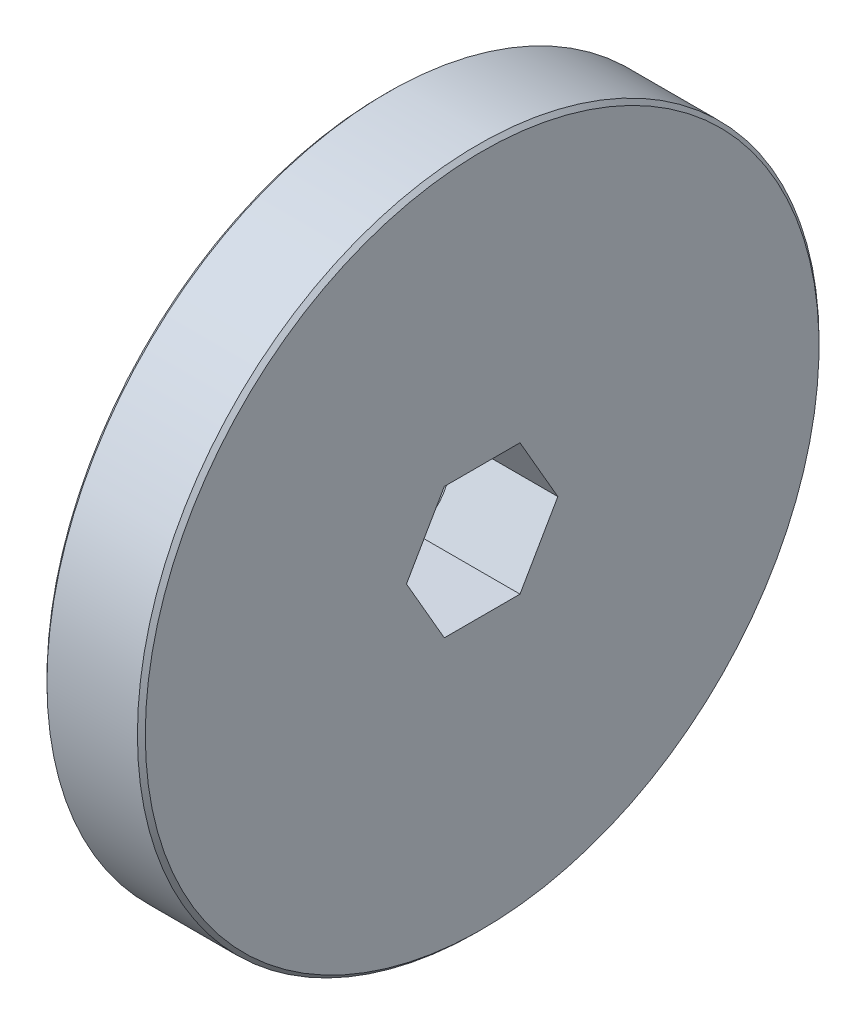
ISO-10303-21;
HEADER;
FILE_DESCRIPTION(('STEP AP214'),'2;1');
FILE_NAME('part.step','',(''),(''),'','','');
FILE_SCHEMA(('AUTOMOTIVE_DESIGN { 1 0 10303 214 1 1 1 1 }'));
ENDSEC;
DATA;
#1=APPLICATION_CONTEXT('core data for automotive mechanical design processes');
#2=APPLICATION_PROTOCOL_DEFINITION('international standard','automotive_design',2000,#1);
#3=PRODUCT_CONTEXT('',#1,'mechanical');
#4=PRODUCT('Part','Part','',(#3));
#5=PRODUCT_RELATED_PRODUCT_CATEGORY('part','',(#4));
#6=PRODUCT_DEFINITION_FORMATION('','',#4);
#7=PRODUCT_DEFINITION_CONTEXT('part definition',#1,'design');
#8=PRODUCT_DEFINITION('design','',#6,#7);
#9=PRODUCT_DEFINITION_SHAPE('','',#8);
#10=(LENGTH_UNIT() NAMED_UNIT(*) SI_UNIT(.MILLI.,.METRE.));
#11=(NAMED_UNIT(*) PLANE_ANGLE_UNIT() SI_UNIT($,.RADIAN.));
#12=(NAMED_UNIT(*) SI_UNIT($,.STERADIAN.) SOLID_ANGLE_UNIT());
#13=UNCERTAINTY_MEASURE_WITH_UNIT(LENGTH_MEASURE(1.E-05),#10,'distance_accuracy_value','');
#14=(GEOMETRIC_REPRESENTATION_CONTEXT(3) GLOBAL_UNCERTAINTY_ASSIGNED_CONTEXT((#13)) GLOBAL_UNIT_ASSIGNED_CONTEXT((#10,
#11,#12)) REPRESENTATION_CONTEXT('',''));
#15=CARTESIAN_POINT('',(0.,0.,0.));
#16=DIRECTION('',(0.,0.,1.));
#17=DIRECTION('',(1.,0.,0.));
#18=AXIS2_PLACEMENT_3D('',#15,#16,#17);
#19=CARTESIAN_POINT('',(837.258566213659,214.232644835281,0.));
#20=DIRECTION('',(1.,0.,0.));
#21=DIRECTION('',(0.,1.,0.));
#22=AXIS2_PLACEMENT_3D('',#19,#20,#21);
#23=TOROIDAL_SURFACE('',#22,8.19150000000003,0.253999999999916);
#24=CARTESIAN_POINT('',(837.512566213659,214.232644835281,0.));
#25=DIRECTION('',(1.,0.,0.));
#26=DIRECTION('',(0.,1.,0.));
#27=AXIS2_PLACEMENT_3D('',#24,#25,#26);
#28=CIRCLE('',#27,8.19149999999999);
#29=CARTESIAN_POINT('',(837.512566213659,222.424144835281,0.));
#30=VERTEX_POINT('',#29);
#31=EDGE_CURVE('E20',#30,#30,#28,.T.);
#32=ORIENTED_EDGE('',*,*,#31,.F.);
#33=EDGE_LOOP('',(#32));
#34=FACE_BOUND('',#33,.T.);
#35=CARTESIAN_POINT('',(837.258566213659,214.232644835281,0.));
#36=DIRECTION('',(1.,0.,0.));
#37=DIRECTION('',(0.,0.,-1.));
#38=AXIS2_PLACEMENT_3D('',#35,#36,#37);
#39=CIRCLE('',#38,7.9375);
#40=CARTESIAN_POINT('',(837.258566213659,214.232644835281,-7.9375));
#41=VERTEX_POINT('',#40);
#42=EDGE_CURVE('E156',#41,#41,#39,.F.);
#43=ORIENTED_EDGE('',*,*,#42,.F.);
#44=EDGE_LOOP('',(#43));
#45=FACE_BOUND('',#44,.T.);
#46=ADVANCED_FACE('F17',(#34,#45),#23,.F.);
#47=CARTESIAN_POINT('',(837.195066213659,214.232644835281,0.));
#48=DIRECTION('',(1.,0.,0.));
#49=DIRECTION('',(0.,0.,-1.));
#50=AXIS2_PLACEMENT_3D('',#47,#48,#49);
#51=CYLINDRICAL_SURFACE('',#50,7.9375);
#52=ORIENTED_EDGE('',*,*,#42,.T.);
#53=EDGE_LOOP('',(#52));
#54=FACE_BOUND('',#53,.T.);
#55=CARTESIAN_POINT('',(837.131566213773,214.232644835281,0.));
#56=DIRECTION('',(1.,0.,0.));
#57=DIRECTION('',(0.,-1.,0.));
#58=AXIS2_PLACEMENT_3D('',#55,#56,#57);
#59=CIRCLE('',#58,7.93749999988619);
#60=CARTESIAN_POINT('',(837.131566213773,206.295144835395,0.));
#61=VERTEX_POINT('',#60);
#62=EDGE_CURVE('E150',#61,#61,#59,.F.);
#63=ORIENTED_EDGE('',*,*,#62,.F.);
#64=EDGE_LOOP('',(#63));
#65=FACE_BOUND('',#64,.T.);
#66=ADVANCED_FACE('F335',(#54,#65),#51,.T.);
#67=CARTESIAN_POINT('',(837.512566213659,234.711394835281,0.));
#68=DIRECTION('',(-1.,0.,0.));
#69=DIRECTION('',(0.,0.,1.));
#70=AXIS2_PLACEMENT_3D('',#67,#68,#69);
#71=PLANE('',#70);
#72=ORIENTED_EDGE('',*,*,#31,.T.);
#73=EDGE_LOOP('',(#72));
#74=FACE_BOUND('',#73,.T.);
#75=CARTESIAN_POINT('',(837.512566213488,214.232644835281,0.));
#76=DIRECTION('',(1.,0.,0.));
#77=DIRECTION('',(0.,0.,-1.));
#78=AXIS2_PLACEMENT_3D('',#75,#76,#77);
#79=CIRCLE('',#78,32.6390000001711);
#80=CARTESIAN_POINT('',(837.512566213488,214.232644835281,-32.6390000001711));
#81=VERTEX_POINT('',#80);
#82=EDGE_CURVE('E153',#81,#81,#79,.T.);
#83=ORIENTED_EDGE('',*,*,#82,.F.);
#84=EDGE_LOOP('',(#83));
#85=FACE_BOUND('',#84,.T.);
#86=ADVANCED_FACE('F326',(#74,#85),#71,.T.);
#87=CARTESIAN_POINT('',(837.131566213773,214.232644835281,0.));
#88=DIRECTION('',(1.,0.,0.));
#89=DIRECTION('',(0.,0.,-1.));
#90=AXIS2_PLACEMENT_3D('',#87,#88,#89);
#91=CONICAL_SURFACE('',#90,7.93749999988616,0.785398162499982);
#92=ORIENTED_EDGE('',*,*,#62,.T.);
#93=EDGE_LOOP('',(#92));
#94=FACE_BOUND('',#93,.T.);
#95=CARTESIAN_POINT('',(836.877566213545,214.232644835281,0.));
#96=DIRECTION('',(1.,0.,0.));
#97=DIRECTION('',(0.,0.,-1.));
#98=AXIS2_PLACEMENT_3D('',#95,#96,#97);
#99=CIRCLE('',#98,7.68350000011406);
#100=CARTESIAN_POINT('',(836.877566213545,214.232644835281,-7.68350000011406));
#101=VERTEX_POINT('',#100);
#102=EDGE_CURVE('E147',#101,#101,#99,.F.);
#103=ORIENTED_EDGE('',*,*,#102,.F.);
#104=EDGE_LOOP('',(#103));
#105=FACE_BOUND('',#104,.T.);
#106=ADVANCED_FACE('F317',(#94,#105),#91,.T.);
#107=CARTESIAN_POINT('',(837.89356621383,214.232644835281,0.));
#108=DIRECTION('',(1.,0.,0.));
#109=DIRECTION('',(0.,0.,-1.));
#110=AXIS2_PLACEMENT_3D('',#107,#108,#109);
#111=CONICAL_SURFACE('',#110,33.019999999829,0.785398162500018);
#112=CARTESIAN_POINT('',(837.893566213659,214.232644835281,0.));
#113=DIRECTION('',(1.,0.,0.));
#114=DIRECTION('',(0.,0.,-1.));
#115=AXIS2_PLACEMENT_3D('',#112,#113,#114);
#116=CIRCLE('',#115,33.02);
#117=CARTESIAN_POINT('',(837.893566213659,214.232644835281,-33.02));
#118=VERTEX_POINT('',#117);
#119=EDGE_CURVE('E144',#118,#118,#116,.T.);
#120=ORIENTED_EDGE('',*,*,#119,.F.);
#121=EDGE_LOOP('',(#120));
#122=FACE_BOUND('',#121,.T.);
#123=ORIENTED_EDGE('',*,*,#82,.T.);
#124=EDGE_LOOP('',(#123));
#125=FACE_BOUND('',#124,.T.);
#126=ADVANCED_FACE('F308',(#122,#125),#111,.T.);
#127=CARTESIAN_POINT('',(836.877566213659,218.201394835281,0.));
#128=DIRECTION('',(-1.,0.,0.));
#129=DIRECTION('',(0.,0.,1.));
#130=AXIS2_PLACEMENT_3D('',#127,#128,#129);
#131=PLANE('',#130);
#132=CARTESIAN_POINT('',(836.877566213161,214.232644835281,0.));
#133=DIRECTION('',(-1.,0.,0.));
#134=DIRECTION('',(0.,0.,1.));
#135=AXIS2_PLACEMENT_3D('',#132,#133,#134);
#136=CIRCLE('',#135,7.36599999950355);
#137=CARTESIAN_POINT('',(836.877566213161,214.232644835281,7.36599999950355));
#138=VERTEX_POINT('',#137);
#139=EDGE_CURVE('E116',#138,#138,#136,.F.);
#140=ORIENTED_EDGE('',*,*,#139,.T.);
#141=EDGE_LOOP('',(#140));
#142=FACE_BOUND('',#141,.T.);
#143=ORIENTED_EDGE('',*,*,#102,.T.);
#144=EDGE_LOOP('',(#143));
#145=FACE_BOUND('',#144,.T.);
#146=ADVANCED_FACE('F300',(#142,#145),#131,.T.);
#147=CARTESIAN_POINT('',(842.275066213659,214.232644835281,0.));
#148=DIRECTION('',(1.,0.,0.));
#149=DIRECTION('',(0.,0.,-1.));
#150=AXIS2_PLACEMENT_3D('',#147,#148,#149);
#151=CYLINDRICAL_SURFACE('',#150,33.02);
#152=CARTESIAN_POINT('',(846.656566213488,214.232644835281,0.));
#153=DIRECTION('',(-1.,0.,0.));
#154=DIRECTION('',(0.,-1.,0.));
#155=AXIS2_PLACEMENT_3D('',#152,#153,#154);
#156=CIRCLE('',#155,33.0199999998289);
#157=CARTESIAN_POINT('',(846.656566213488,181.212644835452,0.));
#158=VERTEX_POINT('',#157);
#159=EDGE_CURVE('E83',#158,#158,#156,.F.);
#160=ORIENTED_EDGE('',*,*,#159,.F.);
#161=EDGE_LOOP('',(#160));
#162=FACE_BOUND('',#161,.T.);
#163=ORIENTED_EDGE('',*,*,#119,.T.);
#164=EDGE_LOOP('',(#163));
#165=FACE_BOUND('',#164,.T.);
#166=ADVANCED_FACE('F222',(#162,#165),#151,.T.);
#167=CARTESIAN_POINT('',(836.877566213218,214.232644835281,0.));
#168=DIRECTION('',(-1.,0.,0.));
#169=DIRECTION('',(0.,0.,1.));
#170=AXIS2_PLACEMENT_3D('',#167,#168,#169);
#171=CONICAL_SURFACE('',#170,7.3659999994467,0.785398162452001);
#172=ORIENTED_EDGE('',*,*,#139,.F.);
#173=EDGE_LOOP('',(#172));
#174=FACE_BOUND('',#173,.T.);
#175=CARTESIAN_POINT('',(836.911217794257,214.232644834923,7.33234841863607));
#176=CARTESIAN_POINT('',(836.973830603347,214.124180683572,7.26972661157141));
#177=CARTESIAN_POINT('',(837.034534089978,214.014887769776,7.20662631833454));
#178=CARTESIAN_POINT('',(837.151546478303,213.794483319738,7.07937574974711));
#179=CARTESIAN_POINT('',(837.207852987084,213.683370832495,7.01522492533614));
#180=CARTESIAN_POINT('',(837.369857452663,213.345897340855,6.82038451410754));
#181=CARTESIAN_POINT('',(837.467875044735,213.116697540088,6.68805594742965));
#182=CARTESIAN_POINT('',(837.637074152675,212.651621421287,6.41954412504063));
#183=CARTESIAN_POINT('',(837.70834649277,212.415770678043,6.283375634941));
#184=CARTESIAN_POINT('',(837.790739840542,212.058147801841,6.07690197110029));
#185=CARTESIAN_POINT('',(837.814104636753,211.938449250899,6.00779398049335));
#186=CARTESIAN_POINT('',(837.852131800152,211.698034210042,5.86899029193359));
#187=CARTESIAN_POINT('',(837.866797060875,211.577318072149,5.79929479722059));
#188=CARTESIAN_POINT('',(837.882441377277,211.389977126495,5.69113345182765));
#189=CARTESIAN_POINT('',(837.886610236211,211.323541823466,5.65277701174747));
#190=CARTESIAN_POINT('',(837.892173188683,211.1906222726,5.57603587325199));
#191=CARTESIAN_POINT('',(837.893568789556,211.124138071011,5.53765120153746));
#192=CARTESIAN_POINT('',(837.893559751848,210.890759884875,5.40291024289958));
#193=CARTESIAN_POINT('',(837.884746021082,210.723818027523,5.30652631668492));
#194=CARTESIAN_POINT('',(837.849974128495,210.391214535692,5.11449760119143));
#195=CARTESIAN_POINT('',(837.824004008835,210.22555387573,5.01885337455021));
#196=CARTESIAN_POINT('',(837.756140277196,209.895930925233,4.82854547533702));
#197=CARTESIAN_POINT('',(837.714173438657,209.731980061256,4.73388839989082));
#198=CARTESIAN_POINT('',(837.616234674376,209.407230636299,4.5463942319762));
#199=CARTESIAN_POINT('',(837.560257345261,209.246433317395,4.45355785662091));
#200=CARTESIAN_POINT('',(837.417453831287,208.879752331086,4.24185449046731));
#201=CARTESIAN_POINT('',(837.326427411754,208.675097477153,4.12369695545861));
#202=CARTESIAN_POINT('',(837.178346077161,208.373561552368,3.94960510811356));
#203=CARTESIAN_POINT('',(837.127319077046,208.274394805897,3.89235116034438));
#204=CARTESIAN_POINT('',(837.021778073516,208.077480800181,3.77866280613645));
#205=CARTESIAN_POINT('',(836.967264650644,207.979733307916,3.72222826516472));
#206=CARTESIAN_POINT('',(836.911217794203,207.882644835598,3.66617420953671));
#207=B_SPLINE_CURVE_WITH_KNOTS('',3,(#175,#176,#177,#178,#179,#180,#181,#182,#183,#184,#185,
#186,#187,#188,#189,#190,#191,#192,#193,#194,#195,#196,#197,#198,#199,#200,#201,#202,#203,#204,
#205,#206),.UNSPECIFIED.,.F.,.F.,(4,2,2,2,2,2,2,2,2,2,2,2,2,2,2,4),(0.,0.420044475301416,
0.840315975752731,1.68589271251405,2.52857139463436,2.94887379457989,3.36903632007069,
3.59946881286421,3.82977602554547,4.40780185575734,4.98623099013496,5.56734037250001,
6.14867421539335,6.90755565769996,7.28360145065073,7.65958478861319),.UNSPECIFIED.);
#208=CARTESIAN_POINT('',(836.911217794206,214.232644835281,7.33234841852208));
#209=VERTEX_POINT('',#208);
#210=CARTESIAN_POINT('',(836.911217794206,207.882644835443,3.66617420926103));
#211=VERTEX_POINT('',#210);
#212=EDGE_CURVE('E90',#209,#211,#207,.T.);
#213=ORIENTED_EDGE('',*,*,#212,.T.);
#214=CARTESIAN_POINT('',(836.911217794257,207.882644835165,3.6661742090074));
#215=CARTESIAN_POINT('',(836.973830603347,207.882644835238,3.54093059500579));
#216=CARTESIAN_POINT('',(837.034534089978,207.88264483527,3.41473000858626));
#217=CARTESIAN_POINT('',(837.151546478303,207.882644835293,3.1602288714524));
#218=CARTESIAN_POINT('',(837.207852987084,207.882644835285,3.03192722261719));
#219=CARTESIAN_POINT('',(837.369857452664,207.882644835273,2.64224640013831));
#220=CARTESIAN_POINT('',(837.467875044735,207.882644835279,2.37758926679267));
#221=CARTESIAN_POINT('',(837.637074152675,207.882644835284,1.84056562202312));
#222=CARTESIAN_POINT('',(837.70834649277,207.882644835283,1.56822864182226));
#223=CARTESIAN_POINT('',(837.790739840542,207.882644835281,1.1552813141368));
#224=CARTESIAN_POINT('',(837.814104636753,207.88264483528,1.01706533292132));
#225=CARTESIAN_POINT('',(837.852131800152,207.882644835283,0.739457955807751));
#226=CARTESIAN_POINT('',(837.866797060875,207.882644835287,0.600066966389303));
#227=CARTESIAN_POINT('',(837.882441377277,207.882644835278,0.383744275587131));
#228=CARTESIAN_POINT('',(837.886610236211,207.882644835272,0.307031395415571));
#229=CARTESIAN_POINT('',(837.892173188682,207.882644835291,0.153549118458618));
#230=CARTESIAN_POINT('',(837.893568789556,207.882644835317,0.0767797750747144));
#231=CARTESIAN_POINT('',(837.893559751848,207.88264483536,-0.192702142127321));
#232=CARTESIAN_POINT('',(837.884746021082,207.882644835302,-0.38546999465605));
#233=CARTESIAN_POINT('',(837.849974128495,207.88264483526,-0.769527425715887));
#234=CARTESIAN_POINT('',(837.824004008835,207.882644835276,-0.960815878971684));
#235=CARTESIAN_POINT('',(837.756140277196,207.882644835287,-1.34143167737843));
#236=CARTESIAN_POINT('',(837.714173438657,207.882644835283,-1.53074582827802));
#237=CARTESIAN_POINT('',(837.616234674376,207.88264483528,-1.90573416411256));
#238=CARTESIAN_POINT('',(837.560257345261,207.882644835281,-2.09140691482126));
#239=CARTESIAN_POINT('',(837.417453831287,207.882644835282,-2.51481364712664));
#240=CARTESIAN_POINT('',(837.326427411754,207.882644835281,-2.75112871714489));
#241=CARTESIAN_POINT('',(837.178346077161,207.882644835281,-3.09931241183528));
#242=CARTESIAN_POINT('',(837.127319077046,207.882644835281,-3.21382030737361));
#243=CARTESIAN_POINT('',(837.021778073516,207.882644835281,-3.44119701578936));
#244=CARTESIAN_POINT('',(836.967264650644,207.882644835281,-3.55406609773275));
#245=CARTESIAN_POINT('',(836.911217794203,207.882644835281,-3.66617420898888));
#246=B_SPLINE_CURVE_WITH_KNOTS('',3,(#214,#215,#216,#217,#218,#219,#220,#221,#222,#223,#224,
#225,#226,#227,#228,#229,#230,#231,#232,#233,#234,#235,#236,#237,#238,#239,#240,#241,#242,#243,
#244,#245),.UNSPECIFIED.,.F.,.F.,(4,2,2,2,2,2,2,2,2,2,2,2,2,2,2,4),(0.,0.420044475301383,
0.840315975752615,1.68589271251407,2.52857139463442,2.94887379457991,3.36903632007072,
3.59946881286417,3.8297760255454,4.40780185575729,4.98623099013489,5.56734037249991,
6.14867421539325,6.90755565769986,7.28360145065072,7.6595847886131),.UNSPECIFIED.);
#247=CARTESIAN_POINT('',(836.911217794206,207.882644835443,-3.66617420926103));
#248=VERTEX_POINT('',#247);
#249=EDGE_CURVE('E102',#211,#248,#246,.T.);
#250=ORIENTED_EDGE('',*,*,#249,.T.);
#251=CARTESIAN_POINT('',(836.911217794257,207.882644835523,-3.66617420962868));
#252=CARTESIAN_POINT('',(836.973830603347,207.991108986947,-3.72879601656565));
#253=CARTESIAN_POINT('',(837.034534089978,208.100401900775,-3.79189630974833));
#254=CARTESIAN_POINT('',(837.151546478303,208.320806350837,-3.9191468782948));
#255=CARTESIAN_POINT('',(837.207852987084,208.431918838071,-3.98329770271905));
#256=CARTESIAN_POINT('',(837.369857452663,208.769392329699,-4.1781381139693));
#257=CARTESIAN_POINT('',(837.467875044735,208.998592130472,-4.31046668063702));
#258=CARTESIAN_POINT('',(837.637074152675,209.463668249278,-4.57897850301747));
#259=CARTESIAN_POINT('',(837.70834649277,209.699518992522,-4.71514699311866));
#260=CARTESIAN_POINT('',(837.790739840542,210.057141868721,-4.92162065696339));
#261=CARTESIAN_POINT('',(837.814104636753,210.176840419662,-4.99072864757195));
#262=CARTESIAN_POINT('',(837.852131800152,210.417255460522,-5.12953233612578));
#263=CARTESIAN_POINT('',(837.866797060875,210.537971598419,-5.19922783083123));
#264=CARTESIAN_POINT('',(837.882441377277,210.725312544064,-5.30738917624048));
#265=CARTESIAN_POINT('',(837.886610236211,210.791747847087,-5.34574561633188));
#266=CARTESIAN_POINT('',(837.892173188682,210.924667397972,-5.42248675479339));
#267=CARTESIAN_POINT('',(837.893568789556,210.991151599588,-5.46087142646276));
#268=CARTESIAN_POINT('',(837.893559751848,211.224529785767,-5.59561238502693));
#269=CARTESIAN_POINT('',(837.884746021082,211.391471643061,-5.69199631134103));
#270=CARTESIAN_POINT('',(837.849974128495,211.72407513485,-5.88402502690739));
#271=CARTESIAN_POINT('',(837.824004008835,211.889735794827,-5.97966925352195));
#272=CARTESIAN_POINT('',(837.756140277196,212.219358745335,-6.1699771527155));
#273=CARTESIAN_POINT('',(837.714173438657,212.383309609308,-6.26463422816889));
#274=CARTESIAN_POINT('',(837.616234674376,212.708059034262,-6.45212839608881));
#275=CARTESIAN_POINT('',(837.560257345261,212.868856353167,-6.54496477144223));
#276=CARTESIAN_POINT('',(837.417453831287,213.235537339477,-6.75666813759401));
#277=CARTESIAN_POINT('',(837.326427411754,213.44019219341,-6.87482567260354));
#278=CARTESIAN_POINT('',(837.178346077161,213.741728118195,-7.04891751994889));
#279=CARTESIAN_POINT('',(837.127319077046,213.840894864665,-7.10617146771804));
#280=CARTESIAN_POINT('',(837.021778073516,214.037808870382,-7.21985982192585));
#281=CARTESIAN_POINT('',(836.967264650644,214.135556362647,-7.27629436289752));
#282=CARTESIAN_POINT('',(836.911217794203,214.232644834965,-7.33234841852561));
#283=B_SPLINE_CURVE_WITH_KNOTS('',3,(#251,#252,#253,#254,#255,#256,#257,#258,#259,#260,#261,
#262,#263,#264,#265,#266,#267,#268,#269,#270,#271,#272,#273,#274,#275,#276,#277,#278,#279,#280,
#281,#282),.UNSPECIFIED.,.F.,.F.,(4,2,2,2,2,2,2,2,2,2,2,2,2,2,2,4),(0.,0.420044475301433,
0.840315975752691,1.68589271251398,2.52857139463422,2.94887379457974,3.36903632007059,
3.59946881286408,3.82977602554536,4.4078018557573,4.98623099013485,5.56734037249987,
6.14867421539321,6.90755565769985,7.28360145065068,7.659584788613),.UNSPECIFIED.);
#284=CARTESIAN_POINT('',(836.911217794206,214.232644835281,-7.33234841852207));
#285=VERTEX_POINT('',#284);
#286=EDGE_CURVE('E107',#248,#285,#283,.T.);
#287=ORIENTED_EDGE('',*,*,#286,.T.);
#288=CARTESIAN_POINT('',(836.911217794257,214.23264483564,-7.3323484186361));
#289=CARTESIAN_POINT('',(836.973830603347,214.34110898699,-7.26972661157143));
#290=CARTESIAN_POINT('',(837.034534089978,214.450401900786,-7.20662631833456));
#291=CARTESIAN_POINT('',(837.151546478303,214.670806350825,-7.07937574974714));
#292=CARTESIAN_POINT('',(837.207852987084,214.781918838067,-7.01522492533617));
#293=CARTESIAN_POINT('',(837.369857452663,215.119392329708,-6.82038451410757));
#294=CARTESIAN_POINT('',(837.467875044735,215.348592130475,-6.68805594742967));
#295=CARTESIAN_POINT('',(837.637074152675,215.813668249276,-6.41954412504065));
#296=CARTESIAN_POINT('',(837.70834649277,216.04951899252,-6.28337563494102));
#297=CARTESIAN_POINT('',(837.790739840542,216.407141868722,-6.07690197110034));
#298=CARTESIAN_POINT('',(837.814104636753,216.526840419664,-6.00779398049341));
#299=CARTESIAN_POINT('',(837.852131800152,216.76725546052,-5.86899029193365));
#300=CARTESIAN_POINT('',(837.866797060875,216.887971598413,-5.79929479722064));
#301=CARTESIAN_POINT('',(837.882441377277,217.075312544068,-5.6911334518277));
#302=CARTESIAN_POINT('',(837.886610236211,217.141747847097,-5.65277701174752));
#303=CARTESIAN_POINT('',(837.892173188682,217.274667397963,-5.57603587325205));
#304=CARTESIAN_POINT('',(837.893568789556,217.341151599552,-5.53765120153752));
#305=CARTESIAN_POINT('',(837.893559751848,217.574529785688,-5.40291024289966));
#306=CARTESIAN_POINT('',(837.884746021082,217.74147164304,-5.30652631668497));
#307=CARTESIAN_POINT('',(837.849974128495,218.074075134871,-5.11449760119145));
#308=CARTESIAN_POINT('',(837.824004008835,218.239735794833,-5.01885337455023));
#309=CARTESIAN_POINT('',(837.756140277196,218.569358745329,-4.82854547533705));
#310=CARTESIAN_POINT('',(837.714173438657,218.733309609306,-4.73388839989086));
#311=CARTESIAN_POINT('',(837.616234674376,219.058059034263,-4.54639423197624));
#312=CARTESIAN_POINT('',(837.560257345261,219.218856353167,-4.45355785662095));
#313=CARTESIAN_POINT('',(837.417453831287,219.585537339477,-4.24185449046735));
#314=CARTESIAN_POINT('',(837.326427411754,219.79019219341,-4.12369695545865));
#315=CARTESIAN_POINT('',(837.178346077161,220.091728118195,-3.9496051081136));
#316=CARTESIAN_POINT('',(837.127319077046,220.190894864665,-3.89235116034441));
#317=CARTESIAN_POINT('',(837.021778073516,220.387808870382,-3.77866280613648));
#318=CARTESIAN_POINT('',(836.967264650644,220.485556362647,-3.72222826516476));
#319=CARTESIAN_POINT('',(836.911217794203,220.582644834965,-3.66617420953676));
#320=B_SPLINE_CURVE_WITH_KNOTS('',3,(#288,#289,#290,#291,#292,#293,#294,#295,#296,#297,#298,
#299,#300,#301,#302,#303,#304,#305,#306,#307,#308,#309,#310,#311,#312,#313,#314,#315,#316,#317,
#318,#319),.UNSPECIFIED.,.F.,.F.,(4,2,2,2,2,2,2,2,2,2,2,2,2,2,2,4),(0.,0.420044475301322,
0.840315975752611,1.68589271251399,2.52857139463424,2.94887379457973,3.36903632007054,
3.59946881286405,3.82977602554536,4.40780185575724,4.98623099013486,5.56734037249985,
6.14867421539322,6.90755565769986,7.28360145065069,7.65958478861304),.UNSPECIFIED.);
#321=CARTESIAN_POINT('',(836.911217794206,220.58264483512,-3.66617420926104));
#322=VERTEX_POINT('',#321);
#323=EDGE_CURVE('E80',#285,#322,#320,.T.);
#324=ORIENTED_EDGE('',*,*,#323,.T.);
#325=CARTESIAN_POINT('',(836.911217794257,220.582644835398,-3.66617420900739));
#326=CARTESIAN_POINT('',(836.973830603347,220.582644835324,-3.54093059500576));
#327=CARTESIAN_POINT('',(837.034534089978,220.582644835293,-3.4147300085862));
#328=CARTESIAN_POINT('',(837.151546478303,220.582644835269,-3.1602288714523));
#329=CARTESIAN_POINT('',(837.207852987084,220.582644835277,-3.03192722261707));
#330=CARTESIAN_POINT('',(837.369857452664,220.58264483529,-2.64224640013818));
#331=CARTESIAN_POINT('',(837.467875044735,220.582644835284,-2.37758926679255));
#332=CARTESIAN_POINT('',(837.637074152675,220.582644835279,-1.84056562202303));
#333=CARTESIAN_POINT('',(837.70834649277,220.58264483528,-1.56822864182219));
#334=CARTESIAN_POINT('',(837.790739840542,220.582644835282,-1.15528131413677));
#335=CARTESIAN_POINT('',(837.814104636753,220.582644835283,-1.01706533292132));
#336=CARTESIAN_POINT('',(837.852131800152,220.58264483528,-0.739457955807771));
#337=CARTESIAN_POINT('',(837.866797060875,220.582644835275,-0.600066966389331));
#338=CARTESIAN_POINT('',(837.882441377277,220.582644835285,-0.383744275587165));
#339=CARTESIAN_POINT('',(837.886610236211,220.582644835291,-0.307031395415602));
#340=CARTESIAN_POINT('',(837.892173188682,220.582644835272,-0.15354911845864));
#341=CARTESIAN_POINT('',(837.893568789556,220.582644835245,-0.0767797750747288));
#342=CARTESIAN_POINT('',(837.893559751848,220.582644835203,0.19270214212733));
#343=CARTESIAN_POINT('',(837.884746021082,220.58264483526,0.385469994656079));
#344=CARTESIAN_POINT('',(837.849974128495,220.582644835302,0.769527425715932));
#345=CARTESIAN_POINT('',(837.824004008835,220.582644835287,0.960815878971725));
#346=CARTESIAN_POINT('',(837.756140277196,220.582644835276,1.34143167737848));
#347=CARTESIAN_POINT('',(837.714173438657,220.58264483528,1.53074582827807));
#348=CARTESIAN_POINT('',(837.616234674376,220.582644835283,1.90573416411259));
#349=CARTESIAN_POINT('',(837.560257345261,220.582644835282,2.09140691482128));
#350=CARTESIAN_POINT('',(837.417453831287,220.582644835281,2.51481364712666));
#351=CARTESIAN_POINT('',(837.326427411754,220.582644835281,2.75112871714493));
#352=CARTESIAN_POINT('',(837.178346077161,220.582644835281,3.09931241183532));
#353=CARTESIAN_POINT('',(837.127319077046,220.582644835281,3.21382030737364));
#354=CARTESIAN_POINT('',(837.021778073516,220.582644835281,3.44119701578937));
#355=CARTESIAN_POINT('',(836.967264650644,220.582644835281,3.55406609773277));
#356=CARTESIAN_POINT('',(836.911217794203,220.582644835281,3.66617420898891));
#357=B_SPLINE_CURVE_WITH_KNOTS('',3,(#325,#326,#327,#328,#329,#330,#331,#332,#333,#334,#335,
#336,#337,#338,#339,#340,#341,#342,#343,#344,#345,#346,#347,#348,#349,#350,#351,#352,#353,#354,
#355,#356),.UNSPECIFIED.,.F.,.F.,(4,2,2,2,2,2,2,2,2,2,2,2,2,2,2,4),(0.,0.420044475301452,
0.840315975752735,1.68589271251416,2.52857139463445,2.94887379457989,3.36903632007067,
3.59946881286413,3.82977602554538,4.4078018557573,4.98623099013492,5.56734037249995,
6.14867421539325,6.90755565769989,7.28360145065072,7.65958478861312),.UNSPECIFIED.);
#358=CARTESIAN_POINT('',(836.911217794113,220.582644835281,3.66617420916796));
#359=VERTEX_POINT('',#358);
#360=EDGE_CURVE('E77',#322,#359,#357,.T.);
#361=ORIENTED_EDGE('',*,*,#360,.T.);
#362=CARTESIAN_POINT('',(836.911217794257,220.582644835039,3.66617420962866));
#363=CARTESIAN_POINT('',(836.973830603347,220.474180683615,3.72879601656562));
#364=CARTESIAN_POINT('',(837.034534089978,220.364887769788,3.79189630974829));
#365=CARTESIAN_POINT('',(837.151546478303,220.144483319726,3.91914687829477));
#366=CARTESIAN_POINT('',(837.207852987084,220.033370832491,3.98329770271902));
#367=CARTESIAN_POINT('',(837.369857452664,219.695897340863,4.17813811396929));
#368=CARTESIAN_POINT('',(837.467875044735,219.46669754009,4.310466680637));
#369=CARTESIAN_POINT('',(837.637074152675,219.001621421284,4.57897850301745));
#370=CARTESIAN_POINT('',(837.70834649277,218.765770678041,4.71514699311866));
#371=CARTESIAN_POINT('',(837.790739840542,218.408147801842,4.92162065696341));
#372=CARTESIAN_POINT('',(837.814104636753,218.288449250901,4.99072864757196));
#373=CARTESIAN_POINT('',(837.852131800152,218.048034210041,5.12953233612578));
#374=CARTESIAN_POINT('',(837.866797060875,217.927318072143,5.19922783083122));
#375=CARTESIAN_POINT('',(837.882441377277,217.739977126498,5.30738917624046));
#376=CARTESIAN_POINT('',(837.886610236211,217.673541823476,5.34574561633185));
#377=CARTESIAN_POINT('',(837.892173188683,217.54062227259,5.42248675479336));
#378=CARTESIAN_POINT('',(837.893568789556,217.474138070975,5.46087142646275));
#379=CARTESIAN_POINT('',(837.893559751848,217.240759884796,5.59561238502692));
#380=CARTESIAN_POINT('',(837.884746021082,217.073818027502,5.69199631134098));
#381=CARTESIAN_POINT('',(837.849974128495,216.741214535713,5.88402502690732));
#382=CARTESIAN_POINT('',(837.824004008835,216.575553875735,5.9796692535219));
#383=CARTESIAN_POINT('',(837.756140277196,216.245930925228,6.16997715271547));
#384=CARTESIAN_POINT('',(837.714173438657,216.081980061255,6.26463422816885));
#385=CARTESIAN_POINT('',(837.616234674376,215.757230636301,6.45212839608878));
#386=CARTESIAN_POINT('',(837.560257345261,215.596433317396,6.5449647714422));
#387=CARTESIAN_POINT('',(837.417453831287,215.229752331086,6.756668137594));
#388=CARTESIAN_POINT('',(837.326427411754,215.025097477153,6.87482567260354));
#389=CARTESIAN_POINT('',(837.178346077161,214.723561552368,7.04891751994889));
#390=CARTESIAN_POINT('',(837.127319077046,214.624394805897,7.10617146771803));
#391=CARTESIAN_POINT('',(837.021778073516,214.427480800181,7.21985982192584));
#392=CARTESIAN_POINT('',(836.967264650644,214.329733307916,7.27629436289751));
#393=CARTESIAN_POINT('',(836.911217794203,214.232644835598,7.33234841852563));
#394=B_SPLINE_CURVE_WITH_KNOTS('',3,(#362,#363,#364,#365,#366,#367,#368,#369,#370,#371,#372,
#373,#374,#375,#376,#377,#378,#379,#380,#381,#382,#383,#384,#385,#386,#387,#388,#389,#390,#391,
#392,#393),.UNSPECIFIED.,.F.,.F.,(4,2,2,2,2,2,2,2,2,2,2,2,2,2,2,4),(0.,0.420044475301424,
0.840315975752686,1.68589271251404,2.52857139463434,2.94887379457981,3.36903632007064,
3.59946881286413,3.82977602554539,4.40780185575725,4.98623099013488,5.56734037249988,
6.14867421539325,6.90755565769995,7.28360145065072,7.6595847886131),.UNSPECIFIED.);
#395=EDGE_CURVE('E67',#359,#209,#394,.T.);
#396=ORIENTED_EDGE('',*,*,#395,.T.);
#397=EDGE_LOOP('',(#213,#250,#287,#324,#361,#396));
#398=FACE_BOUND('',#397,.T.);
#399=ADVANCED_FACE('F78',(#174,#398),#171,.F.);
#400=CARTESIAN_POINT('',(846.656566213488,214.232644835281,0.));
#401=DIRECTION('',(-1.,0.,0.));
#402=DIRECTION('',(0.,0.,1.));
#403=AXIS2_PLACEMENT_3D('',#400,#401,#402);
#404=CONICAL_SURFACE('',#403,33.0199999998289,0.785398162500018);
#405=CARTESIAN_POINT('',(847.03756621383,214.232644835281,0.));
#406=DIRECTION('',(-1.,0.,0.));
#407=DIRECTION('',(0.,0.,1.));
#408=AXIS2_PLACEMENT_3D('',#405,#406,#407);
#409=CIRCLE('',#408,32.6390000001709);
#410=CARTESIAN_POINT('',(847.03756621383,214.232644835281,32.6390000001709));
#411=VERTEX_POINT('',#410);
#412=EDGE_CURVE('E128',#411,#411,#409,.F.);
#413=ORIENTED_EDGE('',*,*,#412,.F.);
#414=EDGE_LOOP('',(#413));
#415=FACE_BOUND('',#414,.T.);
#416=ORIENTED_EDGE('',*,*,#159,.T.);
#417=EDGE_LOOP('',(#416));
#418=FACE_BOUND('',#417,.T.);
#419=ADVANCED_FACE('F215',(#415,#418),#404,.T.);
#420=CARTESIAN_POINT('',(836.877566213659,220.582644835281,3.66617420935411));
#421=DIRECTION('',(0.,1.,0.));
#422=DIRECTION('',(0.,0.,1.));
#423=AXIS2_PLACEMENT_3D('',#420,#421,#422);
#424=PLANE('',#423);
#425=DIRECTION('',(1.,0.,0.));
#426=VECTOR('',#425,1.);
#427=CARTESIAN_POINT('',(836.877566213659,220.582644835281,3.66617420935413));
#428=LINE('',#427,#426);
#429=CARTESIAN_POINT('',(847.037566213659,220.582644835281,3.66617420935412));
#430=VERTEX_POINT('',#429);
#431=EDGE_CURVE('E71',#430,#359,#428,.F.);
#432=ORIENTED_EDGE('',*,*,#431,.T.);
#433=ORIENTED_EDGE('',*,*,#360,.F.);
#434=DIRECTION('',(1.,0.,0.));
#435=VECTOR('',#434,1.);
#436=CARTESIAN_POINT('',(836.877566213659,220.582644835281,-3.66617420935414));
#437=LINE('',#436,#435);
#438=CARTESIAN_POINT('',(847.037566213659,220.582644835281,-3.66617420935414));
#439=VERTEX_POINT('',#438);
#440=EDGE_CURVE('E110',#322,#439,#437,.T.);
#441=ORIENTED_EDGE('',*,*,#440,.T.);
#442=DIRECTION('',(0.,0.,-1.));
#443=VECTOR('',#442,1.);
#444=CARTESIAN_POINT('',(847.037566213659,220.582644835281,0.));
#445=LINE('',#444,#443);
#446=EDGE_CURVE('E87',#430,#439,#445,.T.);
#447=ORIENTED_EDGE('',*,*,#446,.F.);
#448=EDGE_LOOP('',(#432,#433,#441,#447));
#449=FACE_BOUND('',#448,.T.);
#450=ADVANCED_FACE('F85',(#449),#424,.F.);
#451=CARTESIAN_POINT('',(836.877566213659,220.582644835281,-3.66617420935414));
#452=DIRECTION('',(0.,0.5,-0.866025403784439));
#453=DIRECTION('',(0.,0.866025403784439,0.5));
#454=AXIS2_PLACEMENT_3D('',#451,#452,#453);
#455=PLANE('',#454);
#456=ORIENTED_EDGE('',*,*,#440,.F.);
#457=ORIENTED_EDGE('',*,*,#323,.F.);
#458=DIRECTION('',(1.,0.,0.));
#459=VECTOR('',#458,1.);
#460=CARTESIAN_POINT('',(836.877566213659,214.232644835281,-7.33234841870825));
#461=LINE('',#460,#459);
#462=CARTESIAN_POINT('',(847.037566213659,214.232644835281,-7.33234841870825));
#463=VERTEX_POINT('',#462);
#464=EDGE_CURVE('E105',#285,#463,#461,.T.);
#465=ORIENTED_EDGE('',*,*,#464,.T.);
#466=DIRECTION('',(0.,-0.866025403784439,-0.499999999999999));
#467=VECTOR('',#466,1.);
#468=CARTESIAN_POINT('',(847.037566213659,220.582644835281,-3.66617420935414));
#469=LINE('',#468,#467);
#470=EDGE_CURVE('E127',#439,#463,#469,.T.);
#471=ORIENTED_EDGE('',*,*,#470,.F.);
#472=EDGE_LOOP('',(#456,#457,#465,#471));
#473=FACE_BOUND('',#472,.T.);
#474=ADVANCED_FACE('F209',(#473),#455,.F.);
#475=CARTESIAN_POINT('',(836.877566213659,214.232644835281,-7.33234841870825));
#476=DIRECTION('',(0.,-0.5,-0.866025403784438));
#477=DIRECTION('',(0.,0.866025403784438,-0.5));
#478=AXIS2_PLACEMENT_3D('',#475,#476,#477);
#479=PLANE('',#478);
#480=ORIENTED_EDGE('',*,*,#464,.F.);
#481=ORIENTED_EDGE('',*,*,#286,.F.);
#482=DIRECTION('',(1.,0.,0.));
#483=VECTOR('',#482,1.);
#484=CARTESIAN_POINT('',(836.877566213659,207.882644835281,-3.66617420935411));
#485=LINE('',#484,#483);
#486=CARTESIAN_POINT('',(847.037566213659,207.882644835281,-3.66617420935412));
#487=VERTEX_POINT('',#486);
#488=EDGE_CURVE('E100',#248,#487,#485,.T.);
#489=ORIENTED_EDGE('',*,*,#488,.T.);
#490=DIRECTION('',(0.,-0.866025403784438,0.500000000000002));
#491=VECTOR('',#490,1.);
#492=CARTESIAN_POINT('',(847.037566213659,214.232644835281,-7.33234841870825));
#493=LINE('',#492,#491);
#494=EDGE_CURVE('E133',#463,#487,#493,.T.);
#495=ORIENTED_EDGE('',*,*,#494,.F.);
#496=EDGE_LOOP('',(#480,#481,#489,#495));
#497=FACE_BOUND('',#496,.T.);
#498=ADVANCED_FACE('F188',(#497),#479,.F.);
#499=CARTESIAN_POINT('',(836.877566213659,207.882644835281,-3.66617420935411));
#500=DIRECTION('',(0.,-1.,0.));
#501=DIRECTION('',(0.,0.,-1.));
#502=AXIS2_PLACEMENT_3D('',#499,#500,#501);
#503=PLANE('',#502);
#504=ORIENTED_EDGE('',*,*,#488,.F.);
#505=ORIENTED_EDGE('',*,*,#249,.F.);
#506=DIRECTION('',(1.,0.,0.));
#507=VECTOR('',#506,1.);
#508=CARTESIAN_POINT('',(836.877566213659,207.882644835281,3.66617420935411));
#509=LINE('',#508,#507);
#510=CARTESIAN_POINT('',(847.037566213659,207.882644835281,3.66617420935411));
#511=VERTEX_POINT('',#510);
#512=EDGE_CURVE('E88',#211,#511,#509,.T.);
#513=ORIENTED_EDGE('',*,*,#512,.T.);
#514=DIRECTION('',(0.,0.,-1.));
#515=VECTOR('',#514,1.);
#516=CARTESIAN_POINT('',(847.037566213659,207.882644835281,0.));
#517=LINE('',#516,#515);
#518=EDGE_CURVE('E123',#487,#511,#517,.F.);
#519=ORIENTED_EDGE('',*,*,#518,.F.);
#520=EDGE_LOOP('',(#504,#505,#513,#519));
#521=FACE_BOUND('',#520,.T.);
#522=ADVANCED_FACE('F184',(#521),#503,.F.);
#523=CARTESIAN_POINT('',(836.877566213659,207.882644835281,3.66617420935411));
#524=DIRECTION('',(0.,-0.5,0.866025403784439));
#525=DIRECTION('',(0.,-0.866025403784439,-0.5));
#526=AXIS2_PLACEMENT_3D('',#523,#524,#525);
#527=PLANE('',#526);
#528=ORIENTED_EDGE('',*,*,#512,.F.);
#529=ORIENTED_EDGE('',*,*,#212,.F.);
#530=DIRECTION('',(1.,0.,0.));
#531=VECTOR('',#530,1.);
#532=CARTESIAN_POINT('',(836.877566213659,214.232644835281,7.33234841870825));
#533=LINE('',#532,#531);
#534=CARTESIAN_POINT('',(847.037566213659,214.232644835281,7.33234841870825));
#535=VERTEX_POINT('',#534);
#536=EDGE_CURVE('E35',#209,#535,#533,.T.);
#537=ORIENTED_EDGE('',*,*,#536,.T.);
#538=DIRECTION('',(0.,0.866025403784438,0.500000000000002));
#539=VECTOR('',#538,1.);
#540=CARTESIAN_POINT('',(847.037566213659,207.882644835281,3.66617420935411));
#541=LINE('',#540,#539);
#542=EDGE_CURVE('E26',#511,#535,#541,.T.);
#543=ORIENTED_EDGE('',*,*,#542,.F.);
#544=EDGE_LOOP('',(#528,#529,#537,#543));
#545=FACE_BOUND('',#544,.T.);
#546=ADVANCED_FACE('F180',(#545),#527,.F.);
#547=CARTESIAN_POINT('',(836.877566213659,214.232644835281,7.33234841870825));
#548=DIRECTION('',(0.,0.5,0.866025403784438));
#549=DIRECTION('',(0.,-0.866025403784438,0.5));
#550=AXIS2_PLACEMENT_3D('',#547,#548,#549);
#551=PLANE('',#550);
#552=ORIENTED_EDGE('',*,*,#536,.F.);
#553=ORIENTED_EDGE('',*,*,#395,.F.);
#554=ORIENTED_EDGE('',*,*,#431,.F.);
#555=DIRECTION('',(0.,0.866025403784438,-0.500000000000002));
#556=VECTOR('',#555,1.);
#557=CARTESIAN_POINT('',(847.037566213659,214.232644835281,7.33234841870825));
#558=LINE('',#557,#556);
#559=EDGE_CURVE('E11',#535,#430,#558,.T.);
#560=ORIENTED_EDGE('',*,*,#559,.F.);
#561=EDGE_LOOP('',(#552,#553,#554,#560));
#562=FACE_BOUND('',#561,.T.);
#563=ADVANCED_FACE('F69',(#562),#551,.F.);
#564=CARTESIAN_POINT('',(847.037566213659,230.742644835281,0.));
#565=DIRECTION('',(1.,0.,0.));
#566=DIRECTION('',(0.,0.,-1.));
#567=AXIS2_PLACEMENT_3D('',#564,#565,#566);
#568=PLANE('',#567);
#569=ORIENTED_EDGE('',*,*,#542,.T.);
#570=ORIENTED_EDGE('',*,*,#559,.T.);
#571=ORIENTED_EDGE('',*,*,#446,.T.);
#572=ORIENTED_EDGE('',*,*,#470,.T.);
#573=ORIENTED_EDGE('',*,*,#494,.T.);
#574=ORIENTED_EDGE('',*,*,#518,.T.);
#575=EDGE_LOOP('',(#569,#570,#571,#572,#573,#574));
#576=FACE_BOUND('',#575,.T.);
#577=ORIENTED_EDGE('',*,*,#412,.T.);
#578=EDGE_LOOP('',(#577));
#579=FACE_BOUND('',#578,.T.);
#580=ADVANCED_FACE('F179',(#576,#579),#568,.T.);
#581=CLOSED_SHELL('',(#46,#66,#86,#106,#126,#146,#166,#399,#419,#450,#474,#498,#522,#546,#563,#580));
#582=MANIFOLD_SOLID_BREP('B1',#581);
#583=ADVANCED_BREP_SHAPE_REPRESENTATION('',(#18,#582),#14);
#584=SHAPE_DEFINITION_REPRESENTATION(#9,#583);
ENDSEC;
END-ISO-10303-21;
